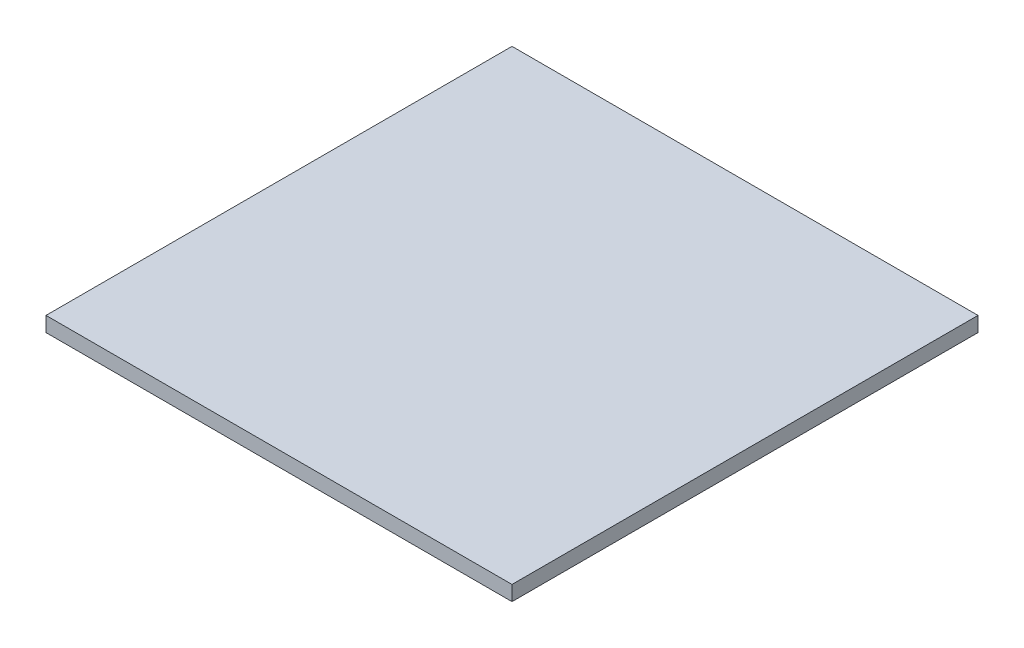
ISO-10303-21;
HEADER;
FILE_DESCRIPTION(('STEP AP214'),'2;1');
FILE_NAME('part.step','',(''),(''),'','','');
FILE_SCHEMA(('AUTOMOTIVE_DESIGN { 1 0 10303 214 1 1 1 1 }'));
ENDSEC;
DATA;
#1=APPLICATION_CONTEXT('core data for automotive mechanical design processes');
#2=APPLICATION_PROTOCOL_DEFINITION('international standard','automotive_design',2000,#1);
#3=PRODUCT_CONTEXT('',#1,'mechanical');
#4=PRODUCT('Part','Part','',(#3));
#5=PRODUCT_RELATED_PRODUCT_CATEGORY('part','',(#4));
#6=PRODUCT_DEFINITION_FORMATION('','',#4);
#7=PRODUCT_DEFINITION_CONTEXT('part definition',#1,'design');
#8=PRODUCT_DEFINITION('design','',#6,#7);
#9=PRODUCT_DEFINITION_SHAPE('','',#8);
#10=(LENGTH_UNIT() NAMED_UNIT(*) SI_UNIT(.MILLI.,.METRE.));
#11=(NAMED_UNIT(*) PLANE_ANGLE_UNIT() SI_UNIT($,.RADIAN.));
#12=(NAMED_UNIT(*) SI_UNIT($,.STERADIAN.) SOLID_ANGLE_UNIT());
#13=UNCERTAINTY_MEASURE_WITH_UNIT(LENGTH_MEASURE(1.E-05),#10,'distance_accuracy_value','');
#14=(GEOMETRIC_REPRESENTATION_CONTEXT(3) GLOBAL_UNCERTAINTY_ASSIGNED_CONTEXT((#13)) GLOBAL_UNIT_ASSIGNED_CONTEXT((#10,
#11,#12)) REPRESENTATION_CONTEXT('',''));
#15=CARTESIAN_POINT('',(0.,0.,0.));
#16=DIRECTION('',(0.,0.,1.));
#17=DIRECTION('',(1.,0.,0.));
#18=AXIS2_PLACEMENT_3D('',#15,#16,#17);
#19=CARTESIAN_POINT('',(-25.,1.6,-25.));
#20=DIRECTION('',(1.,0.,0.));
#21=DIRECTION('',(0.,0.,-1.));
#22=AXIS2_PLACEMENT_3D('',#19,#20,#21);
#23=PLANE('',#22);
#24=DIRECTION('',(0.,0.,1.));
#25=VECTOR('',#24,1.);
#26=CARTESIAN_POINT('',(-25.,0.,-25.));
#27=LINE('',#26,#25);
#28=CARTESIAN_POINT('',(-25.,0.,-25.));
#29=VERTEX_POINT('',#28);
#30=CARTESIAN_POINT('',(-25.,0.,25.));
#31=VERTEX_POINT('',#30);
#32=EDGE_CURVE('E91',#29,#31,#27,.T.);
#33=ORIENTED_EDGE('',*,*,#32,.T.);
#34=DIRECTION('',(0.,-1.,0.));
#35=VECTOR('',#34,1.);
#36=CARTESIAN_POINT('',(-25.,1.6,25.));
#37=LINE('',#36,#35);
#38=CARTESIAN_POINT('',(-25.,1.6,25.));
#39=VERTEX_POINT('',#38);
#40=EDGE_CURVE('E11',#39,#31,#37,.T.);
#41=ORIENTED_EDGE('',*,*,#40,.F.);
#42=DIRECTION('',(0.,0.,1.));
#43=VECTOR('',#42,1.);
#44=CARTESIAN_POINT('',(-25.,1.6,-25.));
#45=LINE('',#44,#43);
#46=CARTESIAN_POINT('',(-25.,1.6,-25.));
#47=VERTEX_POINT('',#46);
#48=EDGE_CURVE('E79',#47,#39,#45,.T.);
#49=ORIENTED_EDGE('',*,*,#48,.F.);
#50=DIRECTION('',(0.,-1.,0.));
#51=VECTOR('',#50,1.);
#52=CARTESIAN_POINT('',(-25.,1.6,-25.));
#53=LINE('',#52,#51);
#54=EDGE_CURVE('E87',#47,#29,#53,.T.);
#55=ORIENTED_EDGE('',*,*,#54,.T.);
#56=EDGE_LOOP('',(#33,#41,#49,#55));
#57=FACE_BOUND('',#56,.T.);
#58=ADVANCED_FACE('F28',(#57),#23,.F.);
#59=CARTESIAN_POINT('',(-25.,1.6,25.));
#60=DIRECTION('',(0.,0.,-1.));
#61=DIRECTION('',(-1.,0.,0.));
#62=AXIS2_PLACEMENT_3D('',#59,#60,#61);
#63=PLANE('',#62);
#64=DIRECTION('',(1.,0.,0.));
#65=VECTOR('',#64,1.);
#66=CARTESIAN_POINT('',(-25.,0.,25.));
#67=LINE('',#66,#65);
#68=CARTESIAN_POINT('',(25.,0.,25.));
#69=VERTEX_POINT('',#68);
#70=EDGE_CURVE('E83',#31,#69,#67,.T.);
#71=ORIENTED_EDGE('',*,*,#70,.T.);
#72=DIRECTION('',(0.,-1.,0.));
#73=VECTOR('',#72,1.);
#74=CARTESIAN_POINT('',(25.,1.6,25.));
#75=LINE('',#74,#73);
#76=CARTESIAN_POINT('',(25.,1.6,25.));
#77=VERTEX_POINT('',#76);
#78=EDGE_CURVE('E36',#77,#69,#75,.T.);
#79=ORIENTED_EDGE('',*,*,#78,.F.);
#80=DIRECTION('',(1.,0.,0.));
#81=VECTOR('',#80,1.);
#82=CARTESIAN_POINT('',(-25.,1.6,25.));
#83=LINE('',#82,#81);
#84=EDGE_CURVE('E74',#39,#77,#83,.T.);
#85=ORIENTED_EDGE('',*,*,#84,.F.);
#86=ORIENTED_EDGE('',*,*,#40,.T.);
#87=EDGE_LOOP('',(#71,#79,#85,#86));
#88=FACE_BOUND('',#87,.T.);
#89=ADVANCED_FACE('F82',(#88),#63,.F.);
#90=CARTESIAN_POINT('',(25.,1.6,-25.0000000000001));
#91=DIRECTION('',(-1.,0.,0.));
#92=DIRECTION('',(0.,0.,1.));
#93=AXIS2_PLACEMENT_3D('',#90,#91,#92);
#94=PLANE('',#93);
#95=DIRECTION('',(0.,0.,-1.));
#96=VECTOR('',#95,1.);
#97=CARTESIAN_POINT('',(25.,0.,-25.0000000000001));
#98=LINE('',#97,#96);
#99=CARTESIAN_POINT('',(25.,0.,-25.0000000000001));
#100=VERTEX_POINT('',#99);
#101=EDGE_CURVE('E61',#69,#100,#98,.T.);
#102=ORIENTED_EDGE('',*,*,#101,.T.);
#103=DIRECTION('',(0.,-1.,0.));
#104=VECTOR('',#103,1.);
#105=CARTESIAN_POINT('',(25.,1.6,-25.0000000000001));
#106=LINE('',#105,#104);
#107=CARTESIAN_POINT('',(25.,1.6,-25.0000000000001));
#108=VERTEX_POINT('',#107);
#109=EDGE_CURVE('E84',#108,#100,#106,.T.);
#110=ORIENTED_EDGE('',*,*,#109,.F.);
#111=DIRECTION('',(0.,0.,-1.));
#112=VECTOR('',#111,1.);
#113=CARTESIAN_POINT('',(25.,1.6,-25.0000000000001));
#114=LINE('',#113,#112);
#115=EDGE_CURVE('E77',#77,#108,#114,.T.);
#116=ORIENTED_EDGE('',*,*,#115,.F.);
#117=ORIENTED_EDGE('',*,*,#78,.T.);
#118=EDGE_LOOP('',(#102,#110,#116,#117));
#119=FACE_BOUND('',#118,.T.);
#120=ADVANCED_FACE('F85',(#119),#94,.F.);
#121=CARTESIAN_POINT('',(-25.,1.6,-25.));
#122=DIRECTION('',(0.,0.,1.));
#123=DIRECTION('',(1.,0.,0.));
#124=AXIS2_PLACEMENT_3D('',#121,#122,#123);
#125=PLANE('',#124);
#126=DIRECTION('',(-1.,0.,0.));
#127=VECTOR('',#126,1.);
#128=CARTESIAN_POINT('',(-25.,0.,-25.));
#129=LINE('',#128,#127);
#130=EDGE_CURVE('E67',#100,#29,#129,.T.);
#131=ORIENTED_EDGE('',*,*,#130,.T.);
#132=ORIENTED_EDGE('',*,*,#54,.F.);
#133=DIRECTION('',(-1.,0.,0.));
#134=VECTOR('',#133,1.);
#135=CARTESIAN_POINT('',(-25.,1.6,-25.));
#136=LINE('',#135,#134);
#137=EDGE_CURVE('E44',#108,#47,#136,.T.);
#138=ORIENTED_EDGE('',*,*,#137,.F.);
#139=ORIENTED_EDGE('',*,*,#109,.T.);
#140=EDGE_LOOP('',(#131,#132,#138,#139));
#141=FACE_BOUND('',#140,.T.);
#142=ADVANCED_FACE('F98',(#141),#125,.F.);
#143=CARTESIAN_POINT('',(0.,1.6,0.));
#144=DIRECTION('',(0.,1.,0.));
#145=DIRECTION('',(0.,0.,1.));
#146=AXIS2_PLACEMENT_3D('',#143,#144,#145);
#147=PLANE('',#146);
#148=ORIENTED_EDGE('',*,*,#48,.T.);
#149=ORIENTED_EDGE('',*,*,#84,.T.);
#150=ORIENTED_EDGE('',*,*,#115,.T.);
#151=ORIENTED_EDGE('',*,*,#137,.T.);
#152=EDGE_LOOP('',(#148,#149,#150,#151));
#153=FACE_BOUND('',#152,.T.);
#154=ADVANCED_FACE('F75',(#153),#147,.T.);
#155=CARTESIAN_POINT('',(0.,0.,0.));
#156=DIRECTION('',(0.,1.,0.));
#157=DIRECTION('',(0.,0.,1.));
#158=AXIS2_PLACEMENT_3D('',#155,#156,#157);
#159=PLANE('',#158);
#160=ORIENTED_EDGE('',*,*,#32,.F.);
#161=ORIENTED_EDGE('',*,*,#130,.F.);
#162=ORIENTED_EDGE('',*,*,#101,.F.);
#163=ORIENTED_EDGE('',*,*,#70,.F.);
#164=EDGE_LOOP('',(#160,#161,#162,#163));
#165=FACE_BOUND('',#164,.T.);
#166=ADVANCED_FACE('F101',(#165),#159,.F.);
#167=CLOSED_SHELL('',(#58,#89,#120,#142,#154,#166));
#168=MANIFOLD_SOLID_BREP('B2',#167);
#169=ADVANCED_BREP_SHAPE_REPRESENTATION('',(#18,#168),#14);
#170=SHAPE_DEFINITION_REPRESENTATION(#9,#169);
ENDSEC;
END-ISO-10303-21;
